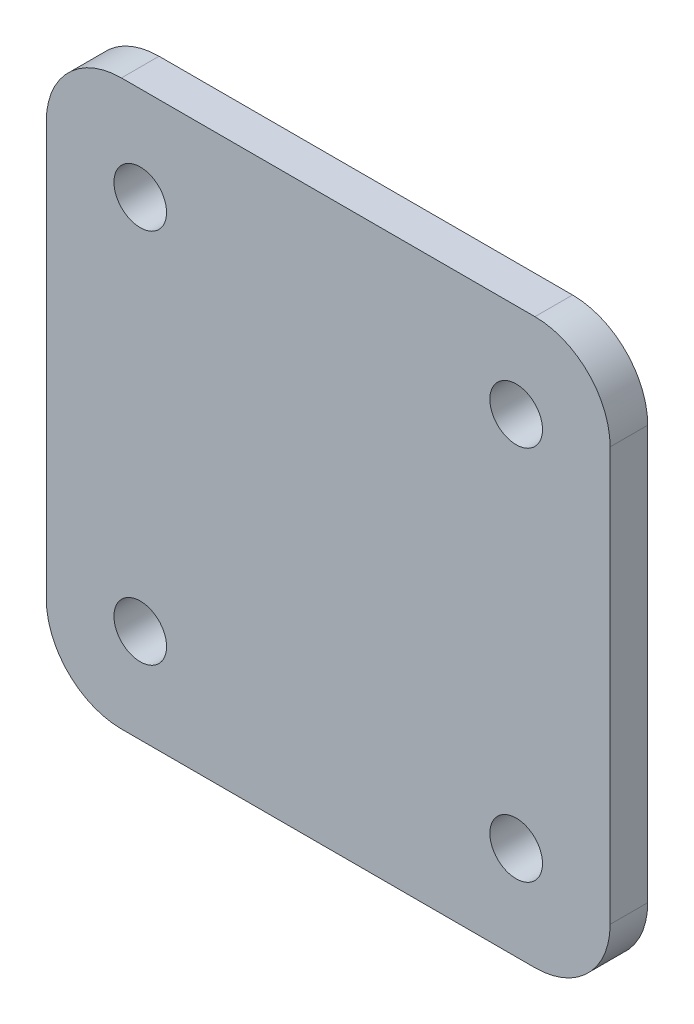
ISO-10303-21;
HEADER;
FILE_DESCRIPTION(('STEP AP214'),'2;1');
FILE_NAME('part.step','',(''),(''),'','','');
FILE_SCHEMA(('AUTOMOTIVE_DESIGN { 1 0 10303 214 1 1 1 1 }'));
ENDSEC;
DATA;
#1=APPLICATION_CONTEXT('core data for automotive mechanical design processes');
#2=APPLICATION_PROTOCOL_DEFINITION('international standard','automotive_design',2000,#1);
#3=PRODUCT_CONTEXT('',#1,'mechanical');
#4=PRODUCT('Part','Part','',(#3));
#5=PRODUCT_RELATED_PRODUCT_CATEGORY('part','',(#4));
#6=PRODUCT_DEFINITION_FORMATION('','',#4);
#7=PRODUCT_DEFINITION_CONTEXT('part definition',#1,'design');
#8=PRODUCT_DEFINITION('design','',#6,#7);
#9=PRODUCT_DEFINITION_SHAPE('','',#8);
#10=(LENGTH_UNIT() NAMED_UNIT(*) SI_UNIT(.MILLI.,.METRE.));
#11=(NAMED_UNIT(*) PLANE_ANGLE_UNIT() SI_UNIT($,.RADIAN.));
#12=(NAMED_UNIT(*) SI_UNIT($,.STERADIAN.) SOLID_ANGLE_UNIT());
#13=UNCERTAINTY_MEASURE_WITH_UNIT(LENGTH_MEASURE(1.E-05),#10,'distance_accuracy_value','');
#14=(GEOMETRIC_REPRESENTATION_CONTEXT(3) GLOBAL_UNCERTAINTY_ASSIGNED_CONTEXT((#13)) GLOBAL_UNIT_ASSIGNED_CONTEXT((#10,
#11,#12)) REPRESENTATION_CONTEXT('',''));
#15=CARTESIAN_POINT('',(0.,0.,0.));
#16=DIRECTION('',(0.,0.,1.));
#17=DIRECTION('',(1.,0.,0.));
#18=AXIS2_PLACEMENT_3D('',#15,#16,#17);
#19=CARTESIAN_POINT('',(-37.5,37.5,5.));
#20=DIRECTION('',(1.,0.,0.));
#21=DIRECTION('',(0.,1.,0.));
#22=AXIS2_PLACEMENT_3D('',#19,#20,#21);
#23=PLANE('',#22);
#24=DIRECTION('',(0.,-1.,0.));
#25=VECTOR('',#24,1.);
#26=CARTESIAN_POINT('',(-37.5,37.5,5.));
#27=LINE('',#26,#25);
#28=CARTESIAN_POINT('',(-37.5,27.5,5.));
#29=VERTEX_POINT('',#28);
#30=CARTESIAN_POINT('',(-37.5,-27.5,5.));
#31=VERTEX_POINT('',#30);
#32=EDGE_CURVE('E121',#29,#31,#27,.T.);
#33=ORIENTED_EDGE('',*,*,#32,.F.);
#34=DIRECTION('',(0.,0.,-1.));
#35=VECTOR('',#34,1.);
#36=CARTESIAN_POINT('',(-37.5,27.5,5.));
#37=LINE('',#36,#35);
#38=CARTESIAN_POINT('',(-37.5,27.5,0.));
#39=VERTEX_POINT('',#38);
#40=EDGE_CURVE('E106',#29,#39,#37,.T.);
#41=ORIENTED_EDGE('',*,*,#40,.T.);
#42=DIRECTION('',(0.,-1.,0.));
#43=VECTOR('',#42,1.);
#44=CARTESIAN_POINT('',(-37.5,37.5,0.));
#45=LINE('',#44,#43);
#46=CARTESIAN_POINT('',(-37.5,-27.5,0.));
#47=VERTEX_POINT('',#46);
#48=EDGE_CURVE('E118',#39,#47,#45,.T.);
#49=ORIENTED_EDGE('',*,*,#48,.T.);
#50=DIRECTION('',(0.,0.,-1.));
#51=VECTOR('',#50,1.);
#52=CARTESIAN_POINT('',(-37.5,-27.5,5.));
#53=LINE('',#52,#51);
#54=EDGE_CURVE('E123',#47,#31,#53,.F.);
#55=ORIENTED_EDGE('',*,*,#54,.T.);
#56=EDGE_LOOP('',(#33,#41,#49,#55));
#57=FACE_BOUND('',#56,.T.);
#58=ADVANCED_FACE('F36',(#57),#23,.F.);
#59=CARTESIAN_POINT('',(-37.5,-37.5,5.));
#60=DIRECTION('',(0.,1.,0.));
#61=DIRECTION('',(-1.,0.,0.));
#62=AXIS2_PLACEMENT_3D('',#59,#60,#61);
#63=PLANE('',#62);
#64=DIRECTION('',(1.,0.,0.));
#65=VECTOR('',#64,1.);
#66=CARTESIAN_POINT('',(-37.5,-37.5,5.));
#67=LINE('',#66,#65);
#68=CARTESIAN_POINT('',(-27.5,-37.5,5.));
#69=VERTEX_POINT('',#68);
#70=CARTESIAN_POINT('',(27.5,-37.5,5.));
#71=VERTEX_POINT('',#70);
#72=EDGE_CURVE('E167',#69,#71,#67,.T.);
#73=ORIENTED_EDGE('',*,*,#72,.F.);
#74=DIRECTION('',(0.,0.,-1.));
#75=VECTOR('',#74,1.);
#76=CARTESIAN_POINT('',(-27.5,-37.5,5.));
#77=LINE('',#76,#75);
#78=CARTESIAN_POINT('',(-27.5,-37.5,0.));
#79=VERTEX_POINT('',#78);
#80=EDGE_CURVE('E160',#69,#79,#77,.T.);
#81=ORIENTED_EDGE('',*,*,#80,.T.);
#82=DIRECTION('',(1.,0.,0.));
#83=VECTOR('',#82,1.);
#84=CARTESIAN_POINT('',(-37.5,-37.5,0.));
#85=LINE('',#84,#83);
#86=CARTESIAN_POINT('',(27.5,-37.5,0.));
#87=VERTEX_POINT('',#86);
#88=EDGE_CURVE('E127',#79,#87,#85,.T.);
#89=ORIENTED_EDGE('',*,*,#88,.T.);
#90=DIRECTION('',(0.,0.,-1.));
#91=VECTOR('',#90,1.);
#92=CARTESIAN_POINT('',(27.5,-37.5,5.));
#93=LINE('',#92,#91);
#94=EDGE_CURVE('E158',#87,#71,#93,.F.);
#95=ORIENTED_EDGE('',*,*,#94,.T.);
#96=EDGE_LOOP('',(#73,#81,#89,#95));
#97=FACE_BOUND('',#96,.T.);
#98=ADVANCED_FACE('F165',(#97),#63,.F.);
#99=CARTESIAN_POINT('',(37.5,37.5,5.));
#100=DIRECTION('',(-1.,0.,0.));
#101=DIRECTION('',(0.,0.,1.));
#102=AXIS2_PLACEMENT_3D('',#99,#100,#101);
#103=PLANE('',#102);
#104=DIRECTION('',(0.,1.,0.));
#105=VECTOR('',#104,1.);
#106=CARTESIAN_POINT('',(37.5,37.5,5.));
#107=LINE('',#106,#105);
#108=CARTESIAN_POINT('',(37.5,-27.5,5.));
#109=VERTEX_POINT('',#108);
#110=CARTESIAN_POINT('',(37.5,27.5,5.));
#111=VERTEX_POINT('',#110);
#112=EDGE_CURVE('E175',#109,#111,#107,.T.);
#113=ORIENTED_EDGE('',*,*,#112,.F.);
#114=DIRECTION('',(0.,0.,-1.));
#115=VECTOR('',#114,1.);
#116=CARTESIAN_POINT('',(37.5,-27.5,5.));
#117=LINE('',#116,#115);
#118=CARTESIAN_POINT('',(37.5,-27.5,0.));
#119=VERTEX_POINT('',#118);
#120=EDGE_CURVE('E11',#109,#119,#117,.T.);
#121=ORIENTED_EDGE('',*,*,#120,.T.);
#122=DIRECTION('',(0.,1.,0.));
#123=VECTOR('',#122,1.);
#124=CARTESIAN_POINT('',(37.5,37.5,0.));
#125=LINE('',#124,#123);
#126=CARTESIAN_POINT('',(37.5,27.5,0.));
#127=VERTEX_POINT('',#126);
#128=EDGE_CURVE('E131',#119,#127,#125,.T.);
#129=ORIENTED_EDGE('',*,*,#128,.T.);
#130=DIRECTION('',(0.,0.,-1.));
#131=VECTOR('',#130,1.);
#132=CARTESIAN_POINT('',(37.5,27.5,5.));
#133=LINE('',#132,#131);
#134=EDGE_CURVE('E44',#127,#111,#133,.F.);
#135=ORIENTED_EDGE('',*,*,#134,.T.);
#136=EDGE_LOOP('',(#113,#121,#129,#135));
#137=FACE_BOUND('',#136,.T.);
#138=ADVANCED_FACE('F174',(#137),#103,.F.);
#139=CARTESIAN_POINT('',(-37.5,37.5,5.));
#140=DIRECTION('',(0.,-1.,0.));
#141=DIRECTION('',(1.,0.,0.));
#142=AXIS2_PLACEMENT_3D('',#139,#140,#141);
#143=PLANE('',#142);
#144=DIRECTION('',(-1.,0.,0.));
#145=VECTOR('',#144,1.);
#146=CARTESIAN_POINT('',(-37.5,37.5,0.));
#147=LINE('',#146,#145);
#148=CARTESIAN_POINT('',(27.5,37.5,0.));
#149=VERTEX_POINT('',#148);
#150=CARTESIAN_POINT('',(-27.5,37.5,0.));
#151=VERTEX_POINT('',#150);
#152=EDGE_CURVE('E141',#149,#151,#147,.T.);
#153=ORIENTED_EDGE('',*,*,#152,.T.);
#154=DIRECTION('',(0.,0.,-1.));
#155=VECTOR('',#154,1.);
#156=CARTESIAN_POINT('',(-27.5,37.5,5.));
#157=LINE('',#156,#155);
#158=CARTESIAN_POINT('',(-27.5,37.5,5.));
#159=VERTEX_POINT('',#158);
#160=EDGE_CURVE('E107',#151,#159,#157,.F.);
#161=ORIENTED_EDGE('',*,*,#160,.T.);
#162=DIRECTION('',(-1.,0.,0.));
#163=VECTOR('',#162,1.);
#164=CARTESIAN_POINT('',(-37.5,37.5,5.));
#165=LINE('',#164,#163);
#166=CARTESIAN_POINT('',(27.5,37.5,5.));
#167=VERTEX_POINT('',#166);
#168=EDGE_CURVE('E137',#167,#159,#165,.T.);
#169=ORIENTED_EDGE('',*,*,#168,.F.);
#170=DIRECTION('',(0.,0.,-1.));
#171=VECTOR('',#170,1.);
#172=CARTESIAN_POINT('',(27.5,37.5,5.));
#173=LINE('',#172,#171);
#174=EDGE_CURVE('E112',#167,#149,#173,.T.);
#175=ORIENTED_EDGE('',*,*,#174,.T.);
#176=EDGE_LOOP('',(#153,#161,#169,#175));
#177=FACE_BOUND('',#176,.T.);
#178=ADVANCED_FACE('F207',(#177),#143,.F.);
#179=CARTESIAN_POINT('',(0.,0.,5.));
#180=DIRECTION('',(0.,0.,1.));
#181=DIRECTION('',(1.,0.,0.));
#182=AXIS2_PLACEMENT_3D('',#179,#180,#181);
#183=PLANE('',#182);
#184=CARTESIAN_POINT('',(-25.,25.,5.));
#185=DIRECTION('',(0.,0.,1.));
#186=DIRECTION('',(1.,0.,0.));
#187=AXIS2_PLACEMENT_3D('',#184,#185,#186);
#188=CIRCLE('',#187,3.5);
#189=CARTESIAN_POINT('',(-21.5,25.,5.));
#190=VERTEX_POINT('',#189);
#191=EDGE_CURVE('E198',#190,#190,#188,.T.);
#192=ORIENTED_EDGE('',*,*,#191,.F.);
#193=EDGE_LOOP('',(#192));
#194=FACE_BOUND('',#193,.T.);
#195=CARTESIAN_POINT('',(-25.,-25.,5.));
#196=DIRECTION('',(0.,0.,1.));
#197=DIRECTION('',(1.,0.,0.));
#198=AXIS2_PLACEMENT_3D('',#195,#196,#197);
#199=CIRCLE('',#198,3.5);
#200=CARTESIAN_POINT('',(-21.5,-25.,5.));
#201=VERTEX_POINT('',#200);
#202=EDGE_CURVE('E192',#201,#201,#199,.T.);
#203=ORIENTED_EDGE('',*,*,#202,.F.);
#204=EDGE_LOOP('',(#203));
#205=FACE_BOUND('',#204,.T.);
#206=CARTESIAN_POINT('',(25.,-25.,5.));
#207=DIRECTION('',(0.,0.,1.));
#208=DIRECTION('',(1.,0.,0.));
#209=AXIS2_PLACEMENT_3D('',#206,#207,#208);
#210=CIRCLE('',#209,3.5);
#211=CARTESIAN_POINT('',(28.5,-25.,5.));
#212=VERTEX_POINT('',#211);
#213=EDGE_CURVE('E186',#212,#212,#210,.T.);
#214=ORIENTED_EDGE('',*,*,#213,.F.);
#215=EDGE_LOOP('',(#214));
#216=FACE_BOUND('',#215,.T.);
#217=CARTESIAN_POINT('',(25.,25.,5.));
#218=DIRECTION('',(0.,0.,1.));
#219=DIRECTION('',(1.,0.,0.));
#220=AXIS2_PLACEMENT_3D('',#217,#218,#219);
#221=CIRCLE('',#220,3.5);
#222=CARTESIAN_POINT('',(28.5,25.,5.));
#223=VERTEX_POINT('',#222);
#224=EDGE_CURVE('E134',#223,#223,#221,.T.);
#225=ORIENTED_EDGE('',*,*,#224,.F.);
#226=EDGE_LOOP('',(#225));
#227=FACE_BOUND('',#226,.T.);
#228=ORIENTED_EDGE('',*,*,#168,.T.);
#229=CARTESIAN_POINT('',(-27.5,27.5,5.));
#230=DIRECTION('',(0.,0.,1.));
#231=DIRECTION('',(1.,0.,0.));
#232=AXIS2_PLACEMENT_3D('',#229,#230,#231);
#233=CIRCLE('',#232,10.);
#234=EDGE_CURVE('E156',#159,#29,#233,.T.);
#235=ORIENTED_EDGE('',*,*,#234,.T.);
#236=ORIENTED_EDGE('',*,*,#32,.T.);
#237=CARTESIAN_POINT('',(-27.5,-27.5,5.));
#238=DIRECTION('',(0.,0.,1.));
#239=DIRECTION('',(1.,0.,0.));
#240=AXIS2_PLACEMENT_3D('',#237,#238,#239);
#241=CIRCLE('',#240,10.);
#242=EDGE_CURVE('E154',#31,#69,#241,.T.);
#243=ORIENTED_EDGE('',*,*,#242,.T.);
#244=ORIENTED_EDGE('',*,*,#72,.T.);
#245=CARTESIAN_POINT('',(27.5,-27.5,5.));
#246=DIRECTION('',(0.,0.,1.));
#247=DIRECTION('',(1.,0.,0.));
#248=AXIS2_PLACEMENT_3D('',#245,#246,#247);
#249=CIRCLE('',#248,10.);
#250=EDGE_CURVE('E57',#71,#109,#249,.T.);
#251=ORIENTED_EDGE('',*,*,#250,.T.);
#252=ORIENTED_EDGE('',*,*,#112,.T.);
#253=CARTESIAN_POINT('',(27.5,27.5,5.));
#254=DIRECTION('',(0.,0.,1.));
#255=DIRECTION('',(1.,0.,0.));
#256=AXIS2_PLACEMENT_3D('',#253,#254,#255);
#257=CIRCLE('',#256,10.);
#258=EDGE_CURVE('E151',#111,#167,#257,.T.);
#259=ORIENTED_EDGE('',*,*,#258,.T.);
#260=EDGE_LOOP('',(#228,#235,#236,#243,#244,#251,#252,#259));
#261=FACE_BOUND('',#260,.T.);
#262=ADVANCED_FACE('F204',(#194,#205,#216,#227,#261),#183,.T.);
#263=CARTESIAN_POINT('',(0.,0.,0.));
#264=DIRECTION('',(0.,0.,1.));
#265=DIRECTION('',(1.,0.,0.));
#266=AXIS2_PLACEMENT_3D('',#263,#264,#265);
#267=PLANE('',#266);
#268=CARTESIAN_POINT('',(-25.,25.,0.));
#269=DIRECTION('',(0.,0.,1.));
#270=DIRECTION('',(1.,0.,0.));
#271=AXIS2_PLACEMENT_3D('',#268,#269,#270);
#272=CIRCLE('',#271,3.5);
#273=CARTESIAN_POINT('',(-21.5,25.,0.));
#274=VERTEX_POINT('',#273);
#275=EDGE_CURVE('E195',#274,#274,#272,.T.);
#276=ORIENTED_EDGE('',*,*,#275,.T.);
#277=EDGE_LOOP('',(#276));
#278=FACE_BOUND('',#277,.T.);
#279=CARTESIAN_POINT('',(-25.,-25.,0.));
#280=DIRECTION('',(0.,0.,1.));
#281=DIRECTION('',(1.,0.,0.));
#282=AXIS2_PLACEMENT_3D('',#279,#280,#281);
#283=CIRCLE('',#282,3.5);
#284=CARTESIAN_POINT('',(-21.5,-25.,0.));
#285=VERTEX_POINT('',#284);
#286=EDGE_CURVE('E189',#285,#285,#283,.T.);
#287=ORIENTED_EDGE('',*,*,#286,.T.);
#288=EDGE_LOOP('',(#287));
#289=FACE_BOUND('',#288,.T.);
#290=CARTESIAN_POINT('',(25.,-25.,0.));
#291=DIRECTION('',(0.,0.,1.));
#292=DIRECTION('',(1.,0.,0.));
#293=AXIS2_PLACEMENT_3D('',#290,#291,#292);
#294=CIRCLE('',#293,3.5);
#295=CARTESIAN_POINT('',(28.5,-25.,0.));
#296=VERTEX_POINT('',#295);
#297=EDGE_CURVE('E183',#296,#296,#294,.T.);
#298=ORIENTED_EDGE('',*,*,#297,.T.);
#299=EDGE_LOOP('',(#298));
#300=FACE_BOUND('',#299,.T.);
#301=CARTESIAN_POINT('',(25.,25.,0.));
#302=DIRECTION('',(0.,0.,1.));
#303=DIRECTION('',(1.,0.,0.));
#304=AXIS2_PLACEMENT_3D('',#301,#302,#303);
#305=CIRCLE('',#304,3.5);
#306=CARTESIAN_POINT('',(28.5,25.,0.));
#307=VERTEX_POINT('',#306);
#308=EDGE_CURVE('E128',#307,#307,#305,.T.);
#309=ORIENTED_EDGE('',*,*,#308,.T.);
#310=EDGE_LOOP('',(#309));
#311=FACE_BOUND('',#310,.T.);
#312=ORIENTED_EDGE('',*,*,#48,.F.);
#313=CARTESIAN_POINT('',(-27.5,27.5,0.));
#314=DIRECTION('',(0.,0.,1.));
#315=DIRECTION('',(1.,0.,0.));
#316=AXIS2_PLACEMENT_3D('',#313,#314,#315);
#317=CIRCLE('',#316,10.);
#318=EDGE_CURVE('E102',#39,#151,#317,.F.);
#319=ORIENTED_EDGE('',*,*,#318,.T.);
#320=ORIENTED_EDGE('',*,*,#152,.F.);
#321=CARTESIAN_POINT('',(27.5,27.5,0.));
#322=DIRECTION('',(0.,0.,1.));
#323=DIRECTION('',(1.,0.,0.));
#324=AXIS2_PLACEMENT_3D('',#321,#322,#323);
#325=CIRCLE('',#324,10.);
#326=EDGE_CURVE('E122',#149,#127,#325,.F.);
#327=ORIENTED_EDGE('',*,*,#326,.T.);
#328=ORIENTED_EDGE('',*,*,#128,.F.);
#329=CARTESIAN_POINT('',(27.5,-27.5,0.));
#330=DIRECTION('',(0.,0.,1.));
#331=DIRECTION('',(1.,0.,0.));
#332=AXIS2_PLACEMENT_3D('',#329,#330,#331);
#333=CIRCLE('',#332,10.);
#334=EDGE_CURVE('E145',#119,#87,#333,.F.);
#335=ORIENTED_EDGE('',*,*,#334,.T.);
#336=ORIENTED_EDGE('',*,*,#88,.F.);
#337=CARTESIAN_POINT('',(-27.5,-27.5,0.));
#338=DIRECTION('',(0.,0.,1.));
#339=DIRECTION('',(1.,0.,0.));
#340=AXIS2_PLACEMENT_3D('',#337,#338,#339);
#341=CIRCLE('',#340,10.);
#342=EDGE_CURVE('E113',#79,#47,#341,.F.);
#343=ORIENTED_EDGE('',*,*,#342,.T.);
#344=EDGE_LOOP('',(#312,#319,#320,#327,#328,#335,#336,#343));
#345=FACE_BOUND('',#344,.T.);
#346=ADVANCED_FACE('F125',(#278,#289,#300,#311,#345),#267,.F.);
#347=CARTESIAN_POINT('',(25.,25.,5.));
#348=DIRECTION('',(0.,0.,1.));
#349=DIRECTION('',(1.,0.,0.));
#350=AXIS2_PLACEMENT_3D('',#347,#348,#349);
#351=CYLINDRICAL_SURFACE('',#350,3.5);
#352=ORIENTED_EDGE('',*,*,#308,.F.);
#353=EDGE_LOOP('',(#352));
#354=FACE_BOUND('',#353,.T.);
#355=ORIENTED_EDGE('',*,*,#224,.T.);
#356=EDGE_LOOP('',(#355));
#357=FACE_BOUND('',#356,.T.);
#358=ADVANCED_FACE('F281',(#354,#357),#351,.F.);
#359=CARTESIAN_POINT('',(25.,-25.,5.));
#360=DIRECTION('',(0.,0.,1.));
#361=DIRECTION('',(1.,0.,0.));
#362=AXIS2_PLACEMENT_3D('',#359,#360,#361);
#363=CYLINDRICAL_SURFACE('',#362,3.5);
#364=ORIENTED_EDGE('',*,*,#297,.F.);
#365=EDGE_LOOP('',(#364));
#366=FACE_BOUND('',#365,.T.);
#367=ORIENTED_EDGE('',*,*,#213,.T.);
#368=EDGE_LOOP('',(#367));
#369=FACE_BOUND('',#368,.T.);
#370=ADVANCED_FACE('F272',(#366,#369),#363,.F.);
#371=CARTESIAN_POINT('',(-25.,-25.,5.));
#372=DIRECTION('',(0.,0.,1.));
#373=DIRECTION('',(1.,0.,0.));
#374=AXIS2_PLACEMENT_3D('',#371,#372,#373);
#375=CYLINDRICAL_SURFACE('',#374,3.5);
#376=ORIENTED_EDGE('',*,*,#286,.F.);
#377=EDGE_LOOP('',(#376));
#378=FACE_BOUND('',#377,.T.);
#379=ORIENTED_EDGE('',*,*,#202,.T.);
#380=EDGE_LOOP('',(#379));
#381=FACE_BOUND('',#380,.T.);
#382=ADVANCED_FACE('F263',(#378,#381),#375,.F.);
#383=CARTESIAN_POINT('',(-25.,25.,5.));
#384=DIRECTION('',(0.,0.,1.));
#385=DIRECTION('',(1.,0.,0.));
#386=AXIS2_PLACEMENT_3D('',#383,#384,#385);
#387=CYLINDRICAL_SURFACE('',#386,3.5);
#388=ORIENTED_EDGE('',*,*,#275,.F.);
#389=EDGE_LOOP('',(#388));
#390=FACE_BOUND('',#389,.T.);
#391=ORIENTED_EDGE('',*,*,#191,.T.);
#392=EDGE_LOOP('',(#391));
#393=FACE_BOUND('',#392,.T.);
#394=ADVANCED_FACE('F202',(#390,#393),#387,.F.);
#395=CARTESIAN_POINT('',(-27.5,27.5,5.));
#396=DIRECTION('',(0.,0.,-1.));
#397=DIRECTION('',(-1.,0.,0.));
#398=AXIS2_PLACEMENT_3D('',#395,#396,#397);
#399=CYLINDRICAL_SURFACE('',#398,10.);
#400=ORIENTED_EDGE('',*,*,#234,.F.);
#401=ORIENTED_EDGE('',*,*,#160,.F.);
#402=ORIENTED_EDGE('',*,*,#318,.F.);
#403=ORIENTED_EDGE('',*,*,#40,.F.);
#404=EDGE_LOOP('',(#400,#401,#402,#403));
#405=FACE_BOUND('',#404,.T.);
#406=ADVANCED_FACE('F105',(#405),#399,.T.);
#407=CARTESIAN_POINT('',(-27.5,-27.5,5.));
#408=DIRECTION('',(0.,0.,-1.));
#409=DIRECTION('',(-1.,0.,0.));
#410=AXIS2_PLACEMENT_3D('',#407,#408,#409);
#411=CYLINDRICAL_SURFACE('',#410,10.);
#412=ORIENTED_EDGE('',*,*,#242,.F.);
#413=ORIENTED_EDGE('',*,*,#54,.F.);
#414=ORIENTED_EDGE('',*,*,#342,.F.);
#415=ORIENTED_EDGE('',*,*,#80,.F.);
#416=EDGE_LOOP('',(#412,#413,#414,#415));
#417=FACE_BOUND('',#416,.T.);
#418=ADVANCED_FACE('F222',(#417),#411,.T.);
#419=CARTESIAN_POINT('',(27.5,-27.5,5.));
#420=DIRECTION('',(0.,0.,-1.));
#421=DIRECTION('',(-1.,0.,0.));
#422=AXIS2_PLACEMENT_3D('',#419,#420,#421);
#423=CYLINDRICAL_SURFACE('',#422,10.);
#424=ORIENTED_EDGE('',*,*,#250,.F.);
#425=ORIENTED_EDGE('',*,*,#94,.F.);
#426=ORIENTED_EDGE('',*,*,#334,.F.);
#427=ORIENTED_EDGE('',*,*,#120,.F.);
#428=EDGE_LOOP('',(#424,#425,#426,#427));
#429=FACE_BOUND('',#428,.T.);
#430=ADVANCED_FACE('F173',(#429),#423,.T.);
#431=CARTESIAN_POINT('',(27.5,27.5,5.));
#432=DIRECTION('',(0.,0.,-1.));
#433=DIRECTION('',(-1.,0.,0.));
#434=AXIS2_PLACEMENT_3D('',#431,#432,#433);
#435=CYLINDRICAL_SURFACE('',#434,10.);
#436=ORIENTED_EDGE('',*,*,#258,.F.);
#437=ORIENTED_EDGE('',*,*,#134,.F.);
#438=ORIENTED_EDGE('',*,*,#326,.F.);
#439=ORIENTED_EDGE('',*,*,#174,.F.);
#440=EDGE_LOOP('',(#436,#437,#438,#439));
#441=FACE_BOUND('',#440,.T.);
#442=ADVANCED_FACE('F38',(#441),#435,.T.);
#443=CLOSED_SHELL('',(#58,#98,#138,#178,#262,#346,#358,#370,#382,#394,#406,#418,#430,#442));
#444=MANIFOLD_SOLID_BREP('B2',#443);
#445=ADVANCED_BREP_SHAPE_REPRESENTATION('',(#18,#444),#14);
#446=SHAPE_DEFINITION_REPRESENTATION(#9,#445);
ENDSEC;
END-ISO-10303-21;
